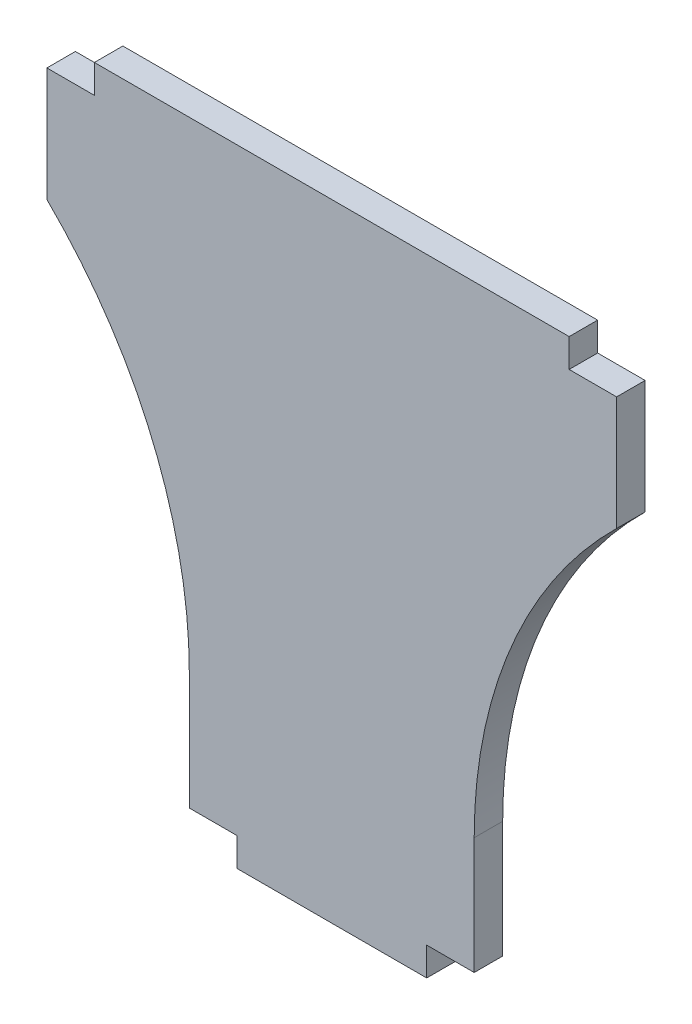
ISO-10303-21;
HEADER;
FILE_DESCRIPTION(('STEP AP214'),'2;1');
FILE_NAME('part.step','',(''),(''),'','','');
FILE_SCHEMA(('AUTOMOTIVE_DESIGN { 1 0 10303 214 1 1 1 1 }'));
ENDSEC;
DATA;
#1=APPLICATION_CONTEXT('core data for automotive mechanical design processes');
#2=APPLICATION_PROTOCOL_DEFINITION('international standard','automotive_design',2000,#1);
#3=PRODUCT_CONTEXT('',#1,'mechanical');
#4=PRODUCT('Part','Part','',(#3));
#5=PRODUCT_RELATED_PRODUCT_CATEGORY('part','',(#4));
#6=PRODUCT_DEFINITION_FORMATION('','',#4);
#7=PRODUCT_DEFINITION_CONTEXT('part definition',#1,'design');
#8=PRODUCT_DEFINITION('design','',#6,#7);
#9=PRODUCT_DEFINITION_SHAPE('','',#8);
#10=(LENGTH_UNIT() NAMED_UNIT(*) SI_UNIT(.MILLI.,.METRE.));
#11=(NAMED_UNIT(*) PLANE_ANGLE_UNIT() SI_UNIT($,.RADIAN.));
#12=(NAMED_UNIT(*) SI_UNIT($,.STERADIAN.) SOLID_ANGLE_UNIT());
#13=UNCERTAINTY_MEASURE_WITH_UNIT(LENGTH_MEASURE(1.E-05),#10,'distance_accuracy_value','');
#14=(GEOMETRIC_REPRESENTATION_CONTEXT(3) GLOBAL_UNCERTAINTY_ASSIGNED_CONTEXT((#13)) GLOBAL_UNIT_ASSIGNED_CONTEXT((#10,
#11,#12)) REPRESENTATION_CONTEXT('',''));
#15=CARTESIAN_POINT('',(0.,0.,0.));
#16=DIRECTION('',(0.,0.,1.));
#17=DIRECTION('',(1.,0.,0.));
#18=AXIS2_PLACEMENT_3D('',#15,#16,#17);
#19=CARTESIAN_POINT('',(15.,24.,1.5));
#20=DIRECTION('',(-1.,0.,0.));
#21=DIRECTION('',(0.,-1.,0.));
#22=AXIS2_PLACEMENT_3D('',#19,#20,#21);
#23=PLANE('',#22);
#24=DIRECTION('',(0.,1.,0.));
#25=VECTOR('',#24,1.);
#26=CARTESIAN_POINT('',(15.,24.,-1.5));
#27=LINE('',#26,#25);
#28=CARTESIAN_POINT('',(15.,-24.,-1.5));
#29=VERTEX_POINT('',#28);
#30=CARTESIAN_POINT('',(15.,-11.7071421427143,-1.5));
#31=VERTEX_POINT('',#30);
#32=EDGE_CURVE('E295',#29,#31,#27,.T.);
#33=ORIENTED_EDGE('',*,*,#32,.T.);
#34=DIRECTION('',(0.,0.,1.));
#35=VECTOR('',#34,1.);
#36=CARTESIAN_POINT('',(15.,-11.7071421427143,1.5));
#37=LINE('',#36,#35);
#38=CARTESIAN_POINT('',(15.,-11.7071421427143,1.5));
#39=VERTEX_POINT('',#38);
#40=EDGE_CURVE('E50',#31,#39,#37,.T.);
#41=ORIENTED_EDGE('',*,*,#40,.T.);
#42=DIRECTION('',(0.,1.,0.));
#43=VECTOR('',#42,1.);
#44=CARTESIAN_POINT('',(15.,24.,1.5));
#45=LINE('',#44,#43);
#46=CARTESIAN_POINT('',(15.,-24.,1.5));
#47=VERTEX_POINT('',#46);
#48=EDGE_CURVE('E151',#47,#39,#45,.T.);
#49=ORIENTED_EDGE('',*,*,#48,.F.);
#50=DIRECTION('',(0.,0.,-1.));
#51=VECTOR('',#50,1.);
#52=CARTESIAN_POINT('',(15.,-24.,1.5));
#53=LINE('',#52,#51);
#54=EDGE_CURVE('E224',#47,#29,#53,.T.);
#55=ORIENTED_EDGE('',*,*,#54,.T.);
#56=EDGE_LOOP('',(#33,#41,#49,#55));
#57=FACE_BOUND('',#56,.T.);
#58=ADVANCED_FACE('F35',(#57),#23,.F.);
#59=CARTESIAN_POINT('',(30.,36.,1.5));
#60=DIRECTION('',(-1.,0.,0.));
#61=DIRECTION('',(0.,-1.,0.));
#62=AXIS2_PLACEMENT_3D('',#59,#60,#61);
#63=PLANE('',#62);
#64=DIRECTION('',(0.,1.,0.));
#65=VECTOR('',#64,1.);
#66=CARTESIAN_POINT('',(30.,36.,-1.5));
#67=LINE('',#66,#65);
#68=CARTESIAN_POINT('',(30.,24.,-1.5));
#69=VERTEX_POINT('',#68);
#70=CARTESIAN_POINT('',(30.,36.,-1.5));
#71=VERTEX_POINT('',#70);
#72=EDGE_CURVE('E268',#69,#71,#67,.T.);
#73=ORIENTED_EDGE('',*,*,#72,.T.);
#74=DIRECTION('',(0.,0.,-1.));
#75=VECTOR('',#74,1.);
#76=CARTESIAN_POINT('',(30.,36.,1.5));
#77=LINE('',#76,#75);
#78=CARTESIAN_POINT('',(30.,36.,1.5));
#79=VERTEX_POINT('',#78);
#80=EDGE_CURVE('E159',#79,#71,#77,.T.);
#81=ORIENTED_EDGE('',*,*,#80,.F.);
#82=DIRECTION('',(0.,1.,0.));
#83=VECTOR('',#82,1.);
#84=CARTESIAN_POINT('',(30.,36.,1.5));
#85=LINE('',#84,#83);
#86=CARTESIAN_POINT('',(30.,24.,1.5));
#87=VERTEX_POINT('',#86);
#88=EDGE_CURVE('E149',#87,#79,#85,.T.);
#89=ORIENTED_EDGE('',*,*,#88,.F.);
#90=DIRECTION('',(0.,0.,-1.));
#91=VECTOR('',#90,1.);
#92=CARTESIAN_POINT('',(30.,24.,1.5));
#93=LINE('',#92,#91);
#94=EDGE_CURVE('E157',#87,#69,#93,.T.);
#95=ORIENTED_EDGE('',*,*,#94,.T.);
#96=EDGE_LOOP('',(#73,#81,#89,#95));
#97=FACE_BOUND('',#96,.T.);
#98=ADVANCED_FACE('F156',(#97),#63,.F.);
#99=CARTESIAN_POINT('',(25.,36.,1.5));
#100=DIRECTION('',(0.,-1.,0.));
#101=DIRECTION('',(1.,0.,0.));
#102=AXIS2_PLACEMENT_3D('',#99,#100,#101);
#103=PLANE('',#102);
#104=DIRECTION('',(-1.,0.,0.));
#105=VECTOR('',#104,1.);
#106=CARTESIAN_POINT('',(25.,36.,-1.5));
#107=LINE('',#106,#105);
#108=CARTESIAN_POINT('',(25.,36.,-1.5));
#109=VERTEX_POINT('',#108);
#110=EDGE_CURVE('E263',#71,#109,#107,.T.);
#111=ORIENTED_EDGE('',*,*,#110,.T.);
#112=DIRECTION('',(0.,0.,-1.));
#113=VECTOR('',#112,1.);
#114=CARTESIAN_POINT('',(25.,36.,1.5));
#115=LINE('',#114,#113);
#116=CARTESIAN_POINT('',(25.,36.,1.5));
#117=VERTEX_POINT('',#116);
#118=EDGE_CURVE('E167',#117,#109,#115,.T.);
#119=ORIENTED_EDGE('',*,*,#118,.F.);
#120=DIRECTION('',(-1.,0.,0.));
#121=VECTOR('',#120,1.);
#122=CARTESIAN_POINT('',(25.,36.,1.5));
#123=LINE('',#122,#121);
#124=EDGE_CURVE('E161',#79,#117,#123,.T.);
#125=ORIENTED_EDGE('',*,*,#124,.F.);
#126=ORIENTED_EDGE('',*,*,#80,.T.);
#127=EDGE_LOOP('',(#111,#119,#125,#126));
#128=FACE_BOUND('',#127,.T.);
#129=ADVANCED_FACE('F296',(#128),#103,.F.);
#130=CARTESIAN_POINT('',(25.,39.,1.5));
#131=DIRECTION('',(-1.,0.,0.));
#132=DIRECTION('',(0.,0.,1.));
#133=AXIS2_PLACEMENT_3D('',#130,#131,#132);
#134=PLANE('',#133);
#135=DIRECTION('',(0.,1.,0.));
#136=VECTOR('',#135,1.);
#137=CARTESIAN_POINT('',(25.,39.,-1.5));
#138=LINE('',#137,#136);
#139=CARTESIAN_POINT('',(25.,39.,-1.5));
#140=VERTEX_POINT('',#139);
#141=EDGE_CURVE('E258',#109,#140,#138,.T.);
#142=ORIENTED_EDGE('',*,*,#141,.T.);
#143=DIRECTION('',(0.,0.,-1.));
#144=VECTOR('',#143,1.);
#145=CARTESIAN_POINT('',(25.,39.,1.5));
#146=LINE('',#145,#144);
#147=CARTESIAN_POINT('',(25.,39.,1.5));
#148=VERTEX_POINT('',#147);
#149=EDGE_CURVE('E249',#148,#140,#146,.T.);
#150=ORIENTED_EDGE('',*,*,#149,.F.);
#151=DIRECTION('',(0.,1.,0.));
#152=VECTOR('',#151,1.);
#153=CARTESIAN_POINT('',(25.,39.,1.5));
#154=LINE('',#153,#152);
#155=EDGE_CURVE('E259',#117,#148,#154,.T.);
#156=ORIENTED_EDGE('',*,*,#155,.F.);
#157=ORIENTED_EDGE('',*,*,#118,.T.);
#158=EDGE_LOOP('',(#142,#150,#156,#157));
#159=FACE_BOUND('',#158,.T.);
#160=ADVANCED_FACE('F256',(#159),#134,.F.);
#161=CARTESIAN_POINT('',(-25.,39.,1.5));
#162=DIRECTION('',(0.,-1.,0.));
#163=DIRECTION('',(0.,0.,-1.));
#164=AXIS2_PLACEMENT_3D('',#161,#162,#163);
#165=PLANE('',#164);
#166=DIRECTION('',(-1.,0.,0.));
#167=VECTOR('',#166,1.);
#168=CARTESIAN_POINT('',(-25.,39.,-1.5));
#169=LINE('',#168,#167);
#170=CARTESIAN_POINT('',(-25.,39.,-1.5));
#171=VERTEX_POINT('',#170);
#172=EDGE_CURVE('E265',#140,#171,#169,.T.);
#173=ORIENTED_EDGE('',*,*,#172,.T.);
#174=DIRECTION('',(0.,0.,-1.));
#175=VECTOR('',#174,1.);
#176=CARTESIAN_POINT('',(-25.,39.,1.5));
#177=LINE('',#176,#175);
#178=CARTESIAN_POINT('',(-25.,39.,1.5));
#179=VERTEX_POINT('',#178);
#180=EDGE_CURVE('E246',#179,#171,#177,.T.);
#181=ORIENTED_EDGE('',*,*,#180,.F.);
#182=DIRECTION('',(-1.,0.,0.));
#183=VECTOR('',#182,1.);
#184=CARTESIAN_POINT('',(-25.,39.,1.5));
#185=LINE('',#184,#183);
#186=EDGE_CURVE('E283',#148,#179,#185,.T.);
#187=ORIENTED_EDGE('',*,*,#186,.F.);
#188=ORIENTED_EDGE('',*,*,#149,.T.);
#189=EDGE_LOOP('',(#173,#181,#187,#188));
#190=FACE_BOUND('',#189,.T.);
#191=ADVANCED_FACE('F302',(#190),#165,.F.);
#192=CARTESIAN_POINT('',(-25.,39.,1.5));
#193=DIRECTION('',(1.,0.,0.));
#194=DIRECTION('',(0.,0.,-1.));
#195=AXIS2_PLACEMENT_3D('',#192,#193,#194);
#196=PLANE('',#195);
#197=DIRECTION('',(0.,-1.,0.));
#198=VECTOR('',#197,1.);
#199=CARTESIAN_POINT('',(-25.,39.,-1.5));
#200=LINE('',#199,#198);
#201=CARTESIAN_POINT('',(-25.,36.,-1.5));
#202=VERTEX_POINT('',#201);
#203=EDGE_CURVE('E211',#171,#202,#200,.T.);
#204=ORIENTED_EDGE('',*,*,#203,.T.);
#205=DIRECTION('',(0.,0.,-1.));
#206=VECTOR('',#205,1.);
#207=CARTESIAN_POINT('',(-25.,36.,1.5));
#208=LINE('',#207,#206);
#209=CARTESIAN_POINT('',(-25.,36.,1.5));
#210=VERTEX_POINT('',#209);
#211=EDGE_CURVE('E243',#210,#202,#208,.T.);
#212=ORIENTED_EDGE('',*,*,#211,.F.);
#213=DIRECTION('',(0.,-1.,0.));
#214=VECTOR('',#213,1.);
#215=CARTESIAN_POINT('',(-25.,39.,1.5));
#216=LINE('',#215,#214);
#217=EDGE_CURVE('E280',#179,#210,#216,.T.);
#218=ORIENTED_EDGE('',*,*,#217,.F.);
#219=ORIENTED_EDGE('',*,*,#180,.T.);
#220=EDGE_LOOP('',(#204,#212,#218,#219));
#221=FACE_BOUND('',#220,.T.);
#222=ADVANCED_FACE('F273',(#221),#196,.F.);
#223=CARTESIAN_POINT('',(-30.,36.,1.5));
#224=DIRECTION('',(0.,-1.,0.));
#225=DIRECTION('',(1.,0.,0.));
#226=AXIS2_PLACEMENT_3D('',#223,#224,#225);
#227=PLANE('',#226);
#228=DIRECTION('',(-1.,0.,0.));
#229=VECTOR('',#228,1.);
#230=CARTESIAN_POINT('',(-30.,36.,-1.5));
#231=LINE('',#230,#229);
#232=CARTESIAN_POINT('',(-30.,36.,-1.5));
#233=VERTEX_POINT('',#232);
#234=EDGE_CURVE('E207',#202,#233,#231,.T.);
#235=ORIENTED_EDGE('',*,*,#234,.T.);
#236=DIRECTION('',(0.,0.,-1.));
#237=VECTOR('',#236,1.);
#238=CARTESIAN_POINT('',(-30.,36.,1.5));
#239=LINE('',#238,#237);
#240=CARTESIAN_POINT('',(-30.,36.,1.5));
#241=VERTEX_POINT('',#240);
#242=EDGE_CURVE('E206',#241,#233,#239,.T.);
#243=ORIENTED_EDGE('',*,*,#242,.F.);
#244=DIRECTION('',(-1.,0.,0.));
#245=VECTOR('',#244,1.);
#246=CARTESIAN_POINT('',(-30.,36.,1.5));
#247=LINE('',#246,#245);
#248=EDGE_CURVE('E279',#210,#241,#247,.T.);
#249=ORIENTED_EDGE('',*,*,#248,.F.);
#250=ORIENTED_EDGE('',*,*,#211,.T.);
#251=EDGE_LOOP('',(#235,#243,#249,#250));
#252=FACE_BOUND('',#251,.T.);
#253=ADVANCED_FACE('F278',(#252),#227,.F.);
#254=CARTESIAN_POINT('',(-30.,36.,1.5));
#255=DIRECTION('',(1.,0.,0.));
#256=DIRECTION('',(0.,1.,0.));
#257=AXIS2_PLACEMENT_3D('',#254,#255,#256);
#258=PLANE('',#257);
#259=DIRECTION('',(0.,-1.,0.));
#260=VECTOR('',#259,1.);
#261=CARTESIAN_POINT('',(-30.,36.,-1.5));
#262=LINE('',#261,#260);
#263=CARTESIAN_POINT('',(-30.,24.,-1.5));
#264=VERTEX_POINT('',#263);
#265=EDGE_CURVE('E199',#233,#264,#262,.T.);
#266=ORIENTED_EDGE('',*,*,#265,.T.);
#267=DIRECTION('',(0.,0.,-1.));
#268=VECTOR('',#267,1.);
#269=CARTESIAN_POINT('',(-30.,24.,1.5));
#270=LINE('',#269,#268);
#271=CARTESIAN_POINT('',(-30.,24.,1.5));
#272=VERTEX_POINT('',#271);
#273=EDGE_CURVE('E194',#272,#264,#270,.T.);
#274=ORIENTED_EDGE('',*,*,#273,.F.);
#275=DIRECTION('',(0.,-1.,0.));
#276=VECTOR('',#275,1.);
#277=CARTESIAN_POINT('',(-30.,36.,1.5));
#278=LINE('',#277,#276);
#279=EDGE_CURVE('E180',#241,#272,#278,.T.);
#280=ORIENTED_EDGE('',*,*,#279,.F.);
#281=ORIENTED_EDGE('',*,*,#242,.T.);
#282=EDGE_LOOP('',(#266,#274,#280,#281));
#283=FACE_BOUND('',#282,.T.);
#284=ADVANCED_FACE('F204',(#283),#258,.F.);
#285=CARTESIAN_POINT('',(-15.,24.,1.5));
#286=DIRECTION('',(1.,0.,0.));
#287=DIRECTION('',(0.,1.,0.));
#288=AXIS2_PLACEMENT_3D('',#285,#286,#287);
#289=PLANE('',#288);
#290=DIRECTION('',(0.,-1.,0.));
#291=VECTOR('',#290,1.);
#292=CARTESIAN_POINT('',(-15.,24.,1.5));
#293=LINE('',#292,#291);
#294=CARTESIAN_POINT('',(-15.,-11.7071421427143,1.5));
#295=VERTEX_POINT('',#294);
#296=CARTESIAN_POINT('',(-15.,-24.,1.5));
#297=VERTEX_POINT('',#296);
#298=EDGE_CURVE('E177',#295,#297,#293,.T.);
#299=ORIENTED_EDGE('',*,*,#298,.F.);
#300=DIRECTION('',(0.,0.,-1.));
#301=VECTOR('',#300,1.);
#302=CARTESIAN_POINT('',(-15.,-11.7071421427143,1.5));
#303=LINE('',#302,#301);
#304=CARTESIAN_POINT('',(-15.,-11.7071421427143,-1.5));
#305=VERTEX_POINT('',#304);
#306=EDGE_CURVE('E163',#295,#305,#303,.T.);
#307=ORIENTED_EDGE('',*,*,#306,.T.);
#308=DIRECTION('',(0.,-1.,0.));
#309=VECTOR('',#308,1.);
#310=CARTESIAN_POINT('',(-15.,24.,-1.5));
#311=LINE('',#310,#309);
#312=CARTESIAN_POINT('',(-15.,-24.,-1.5));
#313=VERTEX_POINT('',#312);
#314=EDGE_CURVE('E201',#305,#313,#311,.T.);
#315=ORIENTED_EDGE('',*,*,#314,.T.);
#316=DIRECTION('',(0.,0.,-1.));
#317=VECTOR('',#316,1.);
#318=CARTESIAN_POINT('',(-15.,-24.,1.5));
#319=LINE('',#318,#317);
#320=EDGE_CURVE('E189',#297,#313,#319,.T.);
#321=ORIENTED_EDGE('',*,*,#320,.F.);
#322=EDGE_LOOP('',(#299,#307,#315,#321));
#323=FACE_BOUND('',#322,.T.);
#324=ADVANCED_FACE('F186',(#323),#289,.F.);
#325=CARTESIAN_POINT('',(-15.,-24.,1.5));
#326=DIRECTION('',(0.,1.,0.));
#327=DIRECTION('',(0.,0.,1.));
#328=AXIS2_PLACEMENT_3D('',#325,#326,#327);
#329=PLANE('',#328);
#330=DIRECTION('',(1.,0.,0.));
#331=VECTOR('',#330,1.);
#332=CARTESIAN_POINT('',(-15.,-24.,-1.5));
#333=LINE('',#332,#331);
#334=CARTESIAN_POINT('',(-10.,-24.,-1.5));
#335=VERTEX_POINT('',#334);
#336=EDGE_CURVE('E209',#313,#335,#333,.T.);
#337=ORIENTED_EDGE('',*,*,#336,.T.);
#338=DIRECTION('',(0.,0.,-1.));
#339=VECTOR('',#338,1.);
#340=CARTESIAN_POINT('',(-10.,-24.,1.5));
#341=LINE('',#340,#339);
#342=CARTESIAN_POINT('',(-10.,-24.,1.5));
#343=VERTEX_POINT('',#342);
#344=EDGE_CURVE('E237',#343,#335,#341,.T.);
#345=ORIENTED_EDGE('',*,*,#344,.F.);
#346=DIRECTION('',(1.,0.,0.));
#347=VECTOR('',#346,1.);
#348=CARTESIAN_POINT('',(-15.,-24.,1.5));
#349=LINE('',#348,#347);
#350=EDGE_CURVE('E191',#297,#343,#349,.T.);
#351=ORIENTED_EDGE('',*,*,#350,.F.);
#352=ORIENTED_EDGE('',*,*,#320,.T.);
#353=EDGE_LOOP('',(#337,#345,#351,#352));
#354=FACE_BOUND('',#353,.T.);
#355=ADVANCED_FACE('F344',(#354),#329,.F.);
#356=CARTESIAN_POINT('',(-10.,-24.,1.5));
#357=DIRECTION('',(1.,0.,0.));
#358=DIRECTION('',(0.,0.,-1.));
#359=AXIS2_PLACEMENT_3D('',#356,#357,#358);
#360=PLANE('',#359);
#361=DIRECTION('',(0.,-1.,0.));
#362=VECTOR('',#361,1.);
#363=CARTESIAN_POINT('',(-10.,-24.,-1.5));
#364=LINE('',#363,#362);
#365=CARTESIAN_POINT('',(-10.,-27.,-1.5));
#366=VERTEX_POINT('',#365);
#367=EDGE_CURVE('E216',#335,#366,#364,.T.);
#368=ORIENTED_EDGE('',*,*,#367,.T.);
#369=DIRECTION('',(0.,0.,-1.));
#370=VECTOR('',#369,1.);
#371=CARTESIAN_POINT('',(-10.,-27.,1.5));
#372=LINE('',#371,#370);
#373=CARTESIAN_POINT('',(-10.,-27.,1.5));
#374=VERTEX_POINT('',#373);
#375=EDGE_CURVE('E234',#374,#366,#372,.T.);
#376=ORIENTED_EDGE('',*,*,#375,.F.);
#377=DIRECTION('',(0.,-1.,0.));
#378=VECTOR('',#377,1.);
#379=CARTESIAN_POINT('',(-10.,-24.,1.5));
#380=LINE('',#379,#378);
#381=EDGE_CURVE('E288',#343,#374,#380,.T.);
#382=ORIENTED_EDGE('',*,*,#381,.F.);
#383=ORIENTED_EDGE('',*,*,#344,.T.);
#384=EDGE_LOOP('',(#368,#376,#382,#383));
#385=FACE_BOUND('',#384,.T.);
#386=ADVANCED_FACE('F340',(#385),#360,.F.);
#387=CARTESIAN_POINT('',(-10.,-27.,1.5));
#388=DIRECTION('',(0.,1.,0.));
#389=DIRECTION('',(0.,0.,1.));
#390=AXIS2_PLACEMENT_3D('',#387,#388,#389);
#391=PLANE('',#390);
#392=DIRECTION('',(1.,0.,0.));
#393=VECTOR('',#392,1.);
#394=CARTESIAN_POINT('',(-10.,-27.,-1.5));
#395=LINE('',#394,#393);
#396=CARTESIAN_POINT('',(10.,-27.,-1.5));
#397=VERTEX_POINT('',#396);
#398=EDGE_CURVE('E218',#366,#397,#395,.T.);
#399=ORIENTED_EDGE('',*,*,#398,.T.);
#400=DIRECTION('',(0.,0.,-1.));
#401=VECTOR('',#400,1.);
#402=CARTESIAN_POINT('',(10.,-27.,1.5));
#403=LINE('',#402,#401);
#404=CARTESIAN_POINT('',(10.,-27.,1.5));
#405=VERTEX_POINT('',#404);
#406=EDGE_CURVE('E231',#405,#397,#403,.T.);
#407=ORIENTED_EDGE('',*,*,#406,.F.);
#408=DIRECTION('',(1.,0.,0.));
#409=VECTOR('',#408,1.);
#410=CARTESIAN_POINT('',(-10.,-27.,1.5));
#411=LINE('',#410,#409);
#412=EDGE_CURVE('E290',#374,#405,#411,.T.);
#413=ORIENTED_EDGE('',*,*,#412,.F.);
#414=ORIENTED_EDGE('',*,*,#375,.T.);
#415=EDGE_LOOP('',(#399,#407,#413,#414));
#416=FACE_BOUND('',#415,.T.);
#417=ADVANCED_FACE('F336',(#416),#391,.F.);
#418=CARTESIAN_POINT('',(10.,-24.,1.5));
#419=DIRECTION('',(-1.,0.,0.));
#420=DIRECTION('',(0.,0.,1.));
#421=AXIS2_PLACEMENT_3D('',#418,#419,#420);
#422=PLANE('',#421);
#423=DIRECTION('',(0.,1.,0.));
#424=VECTOR('',#423,1.);
#425=CARTESIAN_POINT('',(10.,-24.,-1.5));
#426=LINE('',#425,#424);
#427=CARTESIAN_POINT('',(10.,-24.,-1.5));
#428=VERTEX_POINT('',#427);
#429=EDGE_CURVE('E220',#397,#428,#426,.T.);
#430=ORIENTED_EDGE('',*,*,#429,.T.);
#431=DIRECTION('',(0.,0.,-1.));
#432=VECTOR('',#431,1.);
#433=CARTESIAN_POINT('',(10.,-24.,1.5));
#434=LINE('',#433,#432);
#435=CARTESIAN_POINT('',(10.,-24.,1.5));
#436=VERTEX_POINT('',#435);
#437=EDGE_CURVE('E227',#436,#428,#434,.T.);
#438=ORIENTED_EDGE('',*,*,#437,.F.);
#439=DIRECTION('',(0.,1.,0.));
#440=VECTOR('',#439,1.);
#441=CARTESIAN_POINT('',(10.,-24.,1.5));
#442=LINE('',#441,#440);
#443=EDGE_CURVE('E292',#405,#436,#442,.T.);
#444=ORIENTED_EDGE('',*,*,#443,.F.);
#445=ORIENTED_EDGE('',*,*,#406,.T.);
#446=EDGE_LOOP('',(#430,#438,#444,#445));
#447=FACE_BOUND('',#446,.T.);
#448=ADVANCED_FACE('F332',(#447),#422,.F.);
#449=CARTESIAN_POINT('',(10.,-24.,1.5));
#450=DIRECTION('',(0.,1.,0.));
#451=DIRECTION('',(-1.,0.,0.));
#452=AXIS2_PLACEMENT_3D('',#449,#450,#451);
#453=PLANE('',#452);
#454=DIRECTION('',(1.,0.,0.));
#455=VECTOR('',#454,1.);
#456=CARTESIAN_POINT('',(10.,-24.,-1.5));
#457=LINE('',#456,#455);
#458=EDGE_CURVE('E222',#428,#29,#457,.T.);
#459=ORIENTED_EDGE('',*,*,#458,.T.);
#460=ORIENTED_EDGE('',*,*,#54,.F.);
#461=DIRECTION('',(1.,0.,0.));
#462=VECTOR('',#461,1.);
#463=CARTESIAN_POINT('',(10.,-24.,1.5));
#464=LINE('',#463,#462);
#465=EDGE_CURVE('E228',#436,#47,#464,.T.);
#466=ORIENTED_EDGE('',*,*,#465,.F.);
#467=ORIENTED_EDGE('',*,*,#437,.T.);
#468=EDGE_LOOP('',(#459,#460,#466,#467));
#469=FACE_BOUND('',#468,.T.);
#470=ADVANCED_FACE('F327',(#469),#453,.F.);
#471=CARTESIAN_POINT('',(0.,0.,1.5));
#472=DIRECTION('',(0.,0.,1.));
#473=DIRECTION('',(1.,0.,0.));
#474=AXIS2_PLACEMENT_3D('',#471,#472,#473);
#475=PLANE('',#474);
#476=ORIENTED_EDGE('',*,*,#48,.T.);
#477=CARTESIAN_POINT('',(65.,-11.7071421427143,1.5));
#478=DIRECTION('',(0.,0.,1.));
#479=DIRECTION('',(1.,0.,0.));
#480=AXIS2_PLACEMENT_3D('',#477,#478,#479);
#481=CIRCLE('',#480,50.);
#482=EDGE_CURVE('E11',#39,#87,#481,.F.);
#483=ORIENTED_EDGE('',*,*,#482,.T.);
#484=ORIENTED_EDGE('',*,*,#88,.T.);
#485=ORIENTED_EDGE('',*,*,#124,.T.);
#486=ORIENTED_EDGE('',*,*,#155,.T.);
#487=ORIENTED_EDGE('',*,*,#186,.T.);
#488=ORIENTED_EDGE('',*,*,#217,.T.);
#489=ORIENTED_EDGE('',*,*,#248,.T.);
#490=ORIENTED_EDGE('',*,*,#279,.T.);
#491=CARTESIAN_POINT('',(-65.,-11.7071421427143,1.5));
#492=DIRECTION('',(0.,0.,1.));
#493=DIRECTION('',(1.,0.,0.));
#494=AXIS2_PLACEMENT_3D('',#491,#492,#493);
#495=CIRCLE('',#494,50.);
#496=EDGE_CURVE('E174',#272,#295,#495,.F.);
#497=ORIENTED_EDGE('',*,*,#496,.T.);
#498=ORIENTED_EDGE('',*,*,#298,.T.);
#499=ORIENTED_EDGE('',*,*,#350,.T.);
#500=ORIENTED_EDGE('',*,*,#381,.T.);
#501=ORIENTED_EDGE('',*,*,#412,.T.);
#502=ORIENTED_EDGE('',*,*,#443,.T.);
#503=ORIENTED_EDGE('',*,*,#465,.T.);
#504=EDGE_LOOP('',(#476,#483,#484,#485,#486,#487,#488,#489,#490,#497,#498,#499,#500,#501,#502,#503));
#505=FACE_BOUND('',#504,.T.);
#506=ADVANCED_FACE('F148',(#505),#475,.T.);
#507=CARTESIAN_POINT('',(0.,0.,-1.5));
#508=DIRECTION('',(0.,0.,1.));
#509=DIRECTION('',(1.,0.,0.));
#510=AXIS2_PLACEMENT_3D('',#507,#508,#509);
#511=PLANE('',#510);
#512=ORIENTED_EDGE('',*,*,#32,.F.);
#513=ORIENTED_EDGE('',*,*,#458,.F.);
#514=ORIENTED_EDGE('',*,*,#429,.F.);
#515=ORIENTED_EDGE('',*,*,#398,.F.);
#516=ORIENTED_EDGE('',*,*,#367,.F.);
#517=ORIENTED_EDGE('',*,*,#336,.F.);
#518=ORIENTED_EDGE('',*,*,#314,.F.);
#519=CARTESIAN_POINT('',(-65.,-11.7071421427143,-1.5));
#520=DIRECTION('',(0.,0.,1.));
#521=DIRECTION('',(1.,0.,0.));
#522=AXIS2_PLACEMENT_3D('',#519,#520,#521);
#523=CIRCLE('',#522,50.);
#524=EDGE_CURVE('E172',#305,#264,#523,.T.);
#525=ORIENTED_EDGE('',*,*,#524,.T.);
#526=ORIENTED_EDGE('',*,*,#265,.F.);
#527=ORIENTED_EDGE('',*,*,#234,.F.);
#528=ORIENTED_EDGE('',*,*,#203,.F.);
#529=ORIENTED_EDGE('',*,*,#172,.F.);
#530=ORIENTED_EDGE('',*,*,#141,.F.);
#531=ORIENTED_EDGE('',*,*,#110,.F.);
#532=ORIENTED_EDGE('',*,*,#72,.F.);
#533=CARTESIAN_POINT('',(65.,-11.7071421427143,-1.5));
#534=DIRECTION('',(0.,0.,1.));
#535=DIRECTION('',(1.,0.,0.));
#536=AXIS2_PLACEMENT_3D('',#533,#534,#535);
#537=CIRCLE('',#536,50.);
#538=EDGE_CURVE('E43',#69,#31,#537,.T.);
#539=ORIENTED_EDGE('',*,*,#538,.T.);
#540=EDGE_LOOP('',(#512,#513,#514,#515,#516,#517,#518,#525,#526,#527,#528,#529,#530,#531,#532,#539));
#541=FACE_BOUND('',#540,.T.);
#542=ADVANCED_FACE('F197',(#541),#511,.F.);
#543=CARTESIAN_POINT('',(-65.,-11.7071421427143,1.5));
#544=DIRECTION('',(0.,0.,-1.));
#545=DIRECTION('',(-1.,0.,0.));
#546=AXIS2_PLACEMENT_3D('',#543,#544,#545);
#547=CYLINDRICAL_SURFACE('',#546,50.);
#548=ORIENTED_EDGE('',*,*,#496,.F.);
#549=ORIENTED_EDGE('',*,*,#273,.T.);
#550=ORIENTED_EDGE('',*,*,#524,.F.);
#551=ORIENTED_EDGE('',*,*,#306,.F.);
#552=EDGE_LOOP('',(#548,#549,#550,#551));
#553=FACE_BOUND('',#552,.T.);
#554=ADVANCED_FACE('F193',(#553),#547,.F.);
#555=CARTESIAN_POINT('',(65.,-11.7071421427143,1.5));
#556=DIRECTION('',(0.,0.,1.));
#557=DIRECTION('',(1.,0.,0.));
#558=AXIS2_PLACEMENT_3D('',#555,#556,#557);
#559=CYLINDRICAL_SURFACE('',#558,50.);
#560=ORIENTED_EDGE('',*,*,#482,.F.);
#561=ORIENTED_EDGE('',*,*,#40,.F.);
#562=ORIENTED_EDGE('',*,*,#538,.F.);
#563=ORIENTED_EDGE('',*,*,#94,.F.);
#564=EDGE_LOOP('',(#560,#561,#562,#563));
#565=FACE_BOUND('',#564,.T.);
#566=ADVANCED_FACE('F37',(#565),#559,.F.);
#567=CLOSED_SHELL('',(#58,#98,#129,#160,#191,#222,#253,#284,#324,#355,#386,#417,#448,#470,#506,
#542,#554,#566));
#568=MANIFOLD_SOLID_BREP('B2',#567);
#569=ADVANCED_BREP_SHAPE_REPRESENTATION('',(#18,#568),#14);
#570=SHAPE_DEFINITION_REPRESENTATION(#9,#569);
ENDSEC;
END-ISO-10303-21;
